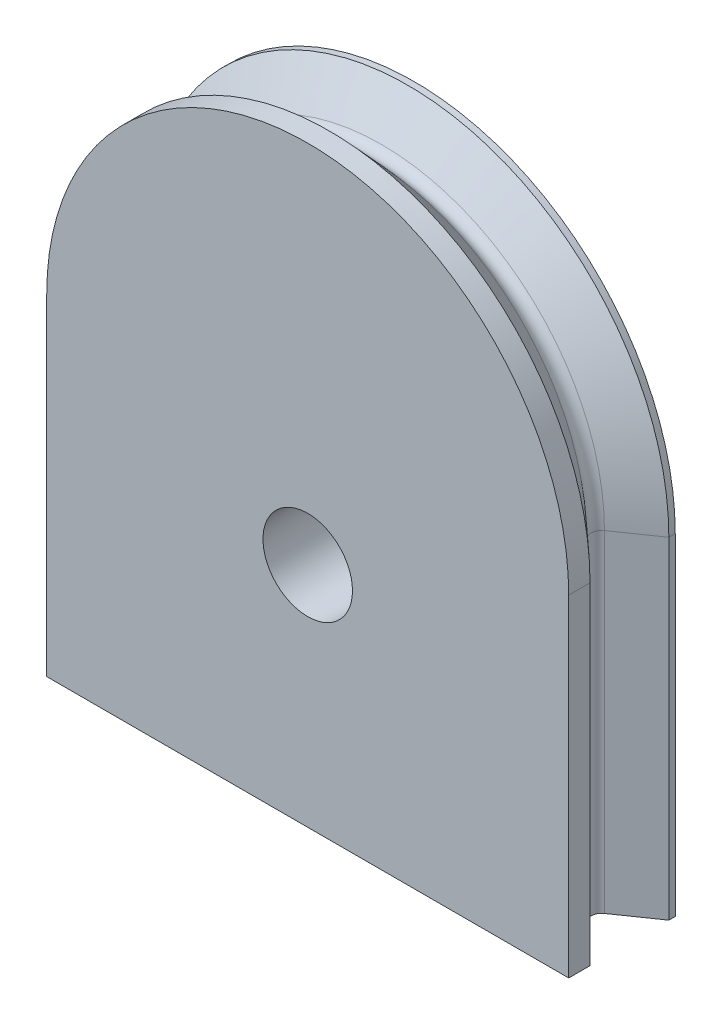
ISO-10303-21;
HEADER;
FILE_DESCRIPTION(('STEP AP214'),'2;1');
FILE_NAME('part.step','',(''),(''),'','','');
FILE_SCHEMA(('AUTOMOTIVE_DESIGN { 1 0 10303 214 1 1 1 1 }'));
ENDSEC;
DATA;
#1=APPLICATION_CONTEXT('core data for automotive mechanical design processes');
#2=APPLICATION_PROTOCOL_DEFINITION('international standard','automotive_design',2000,#1);
#3=PRODUCT_CONTEXT('',#1,'mechanical');
#4=PRODUCT('Part','Part','',(#3));
#5=PRODUCT_RELATED_PRODUCT_CATEGORY('part','',(#4));
#6=PRODUCT_DEFINITION_FORMATION('','',#4);
#7=PRODUCT_DEFINITION_CONTEXT('part definition',#1,'design');
#8=PRODUCT_DEFINITION('design','',#6,#7);
#9=PRODUCT_DEFINITION_SHAPE('','',#8);
#10=(LENGTH_UNIT() NAMED_UNIT(*) SI_UNIT(.MILLI.,.METRE.));
#11=(NAMED_UNIT(*) PLANE_ANGLE_UNIT() SI_UNIT($,.RADIAN.));
#12=(NAMED_UNIT(*) SI_UNIT($,.STERADIAN.) SOLID_ANGLE_UNIT());
#13=UNCERTAINTY_MEASURE_WITH_UNIT(LENGTH_MEASURE(1.E-05),#10,'distance_accuracy_value','');
#14=(GEOMETRIC_REPRESENTATION_CONTEXT(3) GLOBAL_UNCERTAINTY_ASSIGNED_CONTEXT((#13)) GLOBAL_UNIT_ASSIGNED_CONTEXT((#10,
#11,#12)) REPRESENTATION_CONTEXT('',''));
#15=CARTESIAN_POINT('',(0.,0.,0.));
#16=DIRECTION('',(0.,0.,1.));
#17=DIRECTION('',(1.,0.,0.));
#18=AXIS2_PLACEMENT_3D('',#15,#16,#17);
#19=CARTESIAN_POINT('',(1.48873746663725E-09,427.329315402339,345.000000000001));
#20=DIRECTION('',(0.,0.,-1.));
#21=DIRECTION('',(-1.,0.,0.));
#22=AXIS2_PLACEMENT_3D('',#19,#20,#21);
#23=PLANE('',#22);
#24=DIRECTION('',(0.,1.,0.));
#25=VECTOR('',#24,1.);
#26=CARTESIAN_POINT('',(2.10012615747791,429.712168832905,345.000000000001));
#27=LINE('',#26,#25);
#28=CARTESIAN_POINT('',(2.10012615747791,430.223013239108,345.000000000001));
#29=VERTEX_POINT('',#28);
#30=CARTESIAN_POINT('',(2.1001261574759,429.712168832911,345.000000000001));
#31=VERTEX_POINT('',#30);
#32=EDGE_CURVE('E181',#29,#31,#27,.F.);
#33=ORIENTED_EDGE('',*,*,#32,.T.);
#34=CARTESIAN_POINT('',(9.99999999999459,424.435617566144,345.000000000001));
#35=DIRECTION('',(0.,0.,1.));
#36=DIRECTION('',(1.,0.,0.));
#37=AXIS2_PLACEMENT_3D('',#34,#35,#36);
#38=CIRCLE('',#37,9.4999999999225);
#39=CARTESIAN_POINT('',(0.50000000007209,424.435617565571,345.000000000001));
#40=VERTEX_POINT('',#39);
#41=EDGE_CURVE('E225',#40,#31,#38,.F.);
#42=ORIENTED_EDGE('',*,*,#41,.F.);
#43=DIRECTION('',(-1.,0.,0.));
#44=VECTOR('',#43,1.);
#45=CARTESIAN_POINT('',(1.48873746663725E-09,424.435617565571,345.000000000001));
#46=LINE('',#45,#44);
#47=CARTESIAN_POINT('',(-0.49999999770004,424.435617565642,345.000000000001));
#48=VERTEX_POINT('',#47);
#49=EDGE_CURVE('E176',#40,#48,#46,.T.);
#50=ORIENTED_EDGE('',*,*,#49,.T.);
#51=CARTESIAN_POINT('',(-10.0000000000003,424.435617565712,345.000000000001));
#52=DIRECTION('',(0.,0.,1.));
#53=DIRECTION('',(1.,0.,0.));
#54=AXIS2_PLACEMENT_3D('',#51,#52,#53);
#55=CIRCLE('',#54,9.50000000230026);
#56=CARTESIAN_POINT('',(-2.10012615450061,429.712168832297,345.000000000001));
#57=VERTEX_POINT('',#56);
#58=EDGE_CURVE('E215',#57,#48,#55,.F.);
#59=ORIENTED_EDGE('',*,*,#58,.F.);
#60=DIRECTION('',(0.,1.,0.));
#61=VECTOR('',#60,1.);
#62=CARTESIAN_POINT('',(-2.10012615450044,430.223013238468,345.000000000001));
#63=LINE('',#62,#61);
#64=CARTESIAN_POINT('',(-2.1001261545004,430.223013238468,345.000000000001));
#65=VERTEX_POINT('',#64);
#66=EDGE_CURVE('E178',#57,#65,#63,.T.);
#67=ORIENTED_EDGE('',*,*,#66,.T.);
#68=CARTESIAN_POINT('',(-2.85327317332453E-13,440.000000000001,345.000000000001));
#69=DIRECTION('',(0.,0.,1.));
#70=DIRECTION('',(1.,0.,0.));
#71=AXIS2_PLACEMENT_3D('',#68,#69,#70);
#72=CIRCLE('',#71,10.);
#73=EDGE_CURVE('E180',#29,#65,#72,.F.);
#74=ORIENTED_EDGE('',*,*,#73,.F.);
#75=EDGE_LOOP('',(#33,#42,#50,#59,#67,#74));
#76=FACE_BOUND('',#75,.T.);
#77=ADVANCED_FACE('F16',(#76),#23,.T.);
#78=CARTESIAN_POINT('',(-2.84494650060196E-13,440.000000000001,344.300000000001));
#79=DIRECTION('',(0.,0.,-1.));
#80=DIRECTION('',(0.,1.,0.));
#81=AXIS2_PLACEMENT_3D('',#78,#79,#80);
#82=CONICAL_SURFACE('',#81,12.2500000000002,0.963962019791999);
#83=DIRECTION('',(-0.82145743022928,0.,0.570269839918882));
#84=VECTOR('',#83,1.);
#85=CARTESIAN_POINT('',(10.4648650800408,440.000000000079,345.539271284886));
#86=LINE('',#85,#84);
#87=CARTESIAN_POINT('',(10.4648650800408,440.000000000079,345.539271284886));
#88=VERTEX_POINT('',#87);
#89=CARTESIAN_POINT('',(12.2499999999997,440.00000000004,344.300000000001));
#90=VERTEX_POINT('',#89);
#91=EDGE_CURVE('E135',#88,#90,#86,.F.);
#92=ORIENTED_EDGE('',*,*,#91,.T.);
#93=CARTESIAN_POINT('',(-2.84772205816353E-13,440.000000000001,344.300000000001));
#94=DIRECTION('',(0.,0.,1.));
#95=DIRECTION('',(1.,0.,0.));
#96=AXIS2_PLACEMENT_3D('',#93,#94,#95);
#97=CIRCLE('',#96,12.25);
#98=CARTESIAN_POINT('',(-12.2500000000003,439.999999999943,344.300000000001));
#99=VERTEX_POINT('',#98);
#100=EDGE_CURVE('E224',#99,#90,#97,.F.);
#101=ORIENTED_EDGE('',*,*,#100,.F.);
#102=DIRECTION('',(-0.82145743022928,0.,-0.570269839918882));
#103=VECTOR('',#102,1.);
#104=CARTESIAN_POINT('',(-10.4648650800413,439.999999999923,345.539271284886));
#105=LINE('',#104,#103);
#106=CARTESIAN_POINT('',(-10.4648650800413,439.999999999943,345.539271284886));
#107=VERTEX_POINT('',#106);
#108=EDGE_CURVE('E138',#99,#107,#105,.F.);
#109=ORIENTED_EDGE('',*,*,#108,.T.);
#110=CARTESIAN_POINT('',(-2.84772205816353E-13,440.000000000001,345.539271284886));
#111=DIRECTION('',(0.,0.,-1.));
#112=DIRECTION('',(-1.,0.,0.));
#113=AXIS2_PLACEMENT_3D('',#110,#111,#112);
#114=CIRCLE('',#113,10.464865080041);
#115=EDGE_CURVE('E131',#107,#88,#114,.T.);
#116=ORIENTED_EDGE('',*,*,#115,.T.);
#117=EDGE_LOOP('',(#92,#101,#109,#116));
#118=FACE_BOUND('',#117,.T.);
#119=ADVANCED_FACE('F133',(#118),#82,.T.);
#120=CARTESIAN_POINT('',(10.7499999999997,440.000000000079,345.950000000001));
#121=DIRECTION('',(0.,-1.,0.));
#122=DIRECTION('',(1.,0.,0.));
#123=AXIS2_PLACEMENT_3D('',#120,#121,#122);
#124=CYLINDRICAL_SURFACE('',#123,0.500000000000024);
#125=DIRECTION('',(0.,1.,0.));
#126=VECTOR('',#125,1.);
#127=CARTESIAN_POINT('',(10.4124960979293,440.000000000079,346.318905294199));
#128=LINE('',#127,#126);
#129=CARTESIAN_POINT('',(10.4124960979293,440.000000000073,346.318905294199));
#130=VERTEX_POINT('',#129);
#131=CARTESIAN_POINT('',(10.4124960979293,424.435617565601,346.318905294199));
#132=VERTEX_POINT('',#131);
#133=EDGE_CURVE('E247',#130,#132,#128,.F.);
#134=ORIENTED_EDGE('',*,*,#133,.T.);
#135=CARTESIAN_POINT('',(10.7499999999997,424.435617565634,345.950000000001));
#136=DIRECTION('',(0.,-1.,0.));
#137=DIRECTION('',(1.,0.,0.));
#138=AXIS2_PLACEMENT_3D('',#135,#136,#137);
#139=CIRCLE('',#138,0.500000000000024);
#140=CARTESIAN_POINT('',(10.4648650800405,424.435617565601,345.539271284886));
#141=VERTEX_POINT('',#140);
#142=EDGE_CURVE('E19',#141,#132,#139,.F.);
#143=ORIENTED_EDGE('',*,*,#142,.F.);
#144=DIRECTION('',(0.,1.,0.));
#145=VECTOR('',#144,1.);
#146=CARTESIAN_POINT('',(10.4648650800408,440.000000000079,345.539271284886));
#147=LINE('',#146,#145);
#148=EDGE_CURVE('E148',#141,#88,#147,.T.);
#149=ORIENTED_EDGE('',*,*,#148,.T.);
#150=CARTESIAN_POINT('',(10.7499999999997,440.000000000081,345.950000000001));
#151=DIRECTION('',(7.44749851386546E-12,-1.,0.));
#152=DIRECTION('',(1.,7.44749851386546E-12,0.));
#153=AXIS2_PLACEMENT_3D('',#150,#151,#152);
#154=CIRCLE('',#153,0.500000000000024);
#155=EDGE_CURVE('E142',#88,#130,#154,.F.);
#156=ORIENTED_EDGE('',*,*,#155,.T.);
#157=EDGE_LOOP('',(#134,#143,#149,#156));
#158=FACE_BOUND('',#157,.T.);
#159=ADVANCED_FACE('F152',(#158),#124,.F.);
#160=CARTESIAN_POINT('',(-2.84772205816353E-13,440.000000000001,345.950000000001));
#161=DIRECTION('',(0.,0.,-1.));
#162=DIRECTION('',(-1.,0.,0.));
#163=AXIS2_PLACEMENT_3D('',#160,#161,#162);
#164=TOROIDAL_SURFACE('',#163,10.75,0.500000000000024);
#165=CARTESIAN_POINT('',(-2.84772205816353E-13,440.000000000001,346.318905294199));
#166=DIRECTION('',(0.,0.,1.));
#167=DIRECTION('',(-1.,0.,0.));
#168=AXIS2_PLACEMENT_3D('',#165,#166,#167);
#169=CIRCLE('',#168,10.4124960979296);
#170=CARTESIAN_POINT('',(-10.4124960979298,439.999999999923,346.318905294199));
#171=VERTEX_POINT('',#170);
#172=EDGE_CURVE('E158',#130,#171,#169,.T.);
#173=ORIENTED_EDGE('',*,*,#172,.F.);
#174=ORIENTED_EDGE('',*,*,#155,.F.);
#175=ORIENTED_EDGE('',*,*,#115,.F.);
#176=CARTESIAN_POINT('',(-10.7500000000003,439.999999999923,345.950000000001));
#177=DIRECTION('',(0.,1.,0.));
#178=DIRECTION('',(0.,0.,1.));
#179=AXIS2_PLACEMENT_3D('',#176,#177,#178);
#180=CIRCLE('',#179,0.500000000000024);
#181=EDGE_CURVE('E160',#107,#171,#180,.F.);
#182=ORIENTED_EDGE('',*,*,#181,.T.);
#183=EDGE_LOOP('',(#173,#174,#175,#182));
#184=FACE_BOUND('',#183,.T.);
#185=ADVANCED_FACE('F156',(#184),#164,.F.);
#186=CARTESIAN_POINT('',(-10.7500000000003,424.435617565634,345.950000000001));
#187=DIRECTION('',(0.,1.,0.));
#188=DIRECTION('',(0.,0.,1.));
#189=AXIS2_PLACEMENT_3D('',#186,#187,#188);
#190=CYLINDRICAL_SURFACE('',#189,0.500000000000024);
#191=DIRECTION('',(0.,1.,0.));
#192=VECTOR('',#191,1.);
#193=CARTESIAN_POINT('',(-10.4124960979298,424.435617565634,346.318905294199));
#194=LINE('',#193,#192);
#195=CARTESIAN_POINT('',(-10.4124960979298,424.435617565667,346.318905294199));
#196=VERTEX_POINT('',#195);
#197=EDGE_CURVE('E292',#196,#171,#194,.T.);
#198=ORIENTED_EDGE('',*,*,#197,.T.);
#199=ORIENTED_EDGE('',*,*,#181,.F.);
#200=DIRECTION('',(0.,1.,0.));
#201=VECTOR('',#200,1.);
#202=CARTESIAN_POINT('',(-10.4648650800413,424.435617565634,345.539271284886));
#203=LINE('',#202,#201);
#204=CARTESIAN_POINT('',(-10.4648650800411,424.435617565667,345.539271284886));
#205=VERTEX_POINT('',#204);
#206=EDGE_CURVE('E171',#107,#205,#203,.F.);
#207=ORIENTED_EDGE('',*,*,#206,.T.);
#208=CARTESIAN_POINT('',(-10.7500000000003,424.435617565634,345.950000000001));
#209=DIRECTION('',(0.,1.,0.));
#210=DIRECTION('',(0.,0.,1.));
#211=AXIS2_PLACEMENT_3D('',#208,#209,#210);
#212=CIRCLE('',#211,0.500000000000024);
#213=EDGE_CURVE('E162',#196,#205,#212,.T.);
#214=ORIENTED_EDGE('',*,*,#213,.F.);
#215=EDGE_LOOP('',(#198,#199,#207,#214));
#216=FACE_BOUND('',#215,.T.);
#217=ADVANCED_FACE('F245',(#216),#190,.F.);
#218=CARTESIAN_POINT('',(-2.10012615450044,430.223013238468,344.000000000001));
#219=DIRECTION('',(-1.,0.,0.));
#220=DIRECTION('',(0.,0.,1.));
#221=AXIS2_PLACEMENT_3D('',#218,#219,#220);
#222=PLANE('',#221);
#223=DIRECTION('',(0.,0.,1.));
#224=VECTOR('',#223,1.);
#225=CARTESIAN_POINT('',(-2.10012615450036,430.223013238468,344.000000000001));
#226=LINE('',#225,#224);
#227=CARTESIAN_POINT('',(-2.1001261545004,430.223013238468,344.000000000001));
#228=VERTEX_POINT('',#227);
#229=EDGE_CURVE('E230',#65,#228,#226,.F.);
#230=ORIENTED_EDGE('',*,*,#229,.F.);
#231=ORIENTED_EDGE('',*,*,#66,.F.);
#232=DIRECTION('',(0.,0.,1.));
#233=VECTOR('',#232,1.);
#234=CARTESIAN_POINT('',(-2.10012615450077,429.712168832297,344.000000000001));
#235=LINE('',#234,#233);
#236=CARTESIAN_POINT('',(-2.10012615450061,429.712168832297,344.000000000001));
#237=VERTEX_POINT('',#236);
#238=EDGE_CURVE('E219',#237,#57,#235,.T.);
#239=ORIENTED_EDGE('',*,*,#238,.F.);
#240=DIRECTION('',(0.,1.,0.));
#241=VECTOR('',#240,1.);
#242=CARTESIAN_POINT('',(-2.10012615450044,438.342808782779,344.000000000001));
#243=LINE('',#242,#241);
#244=EDGE_CURVE('E214',#237,#228,#243,.T.);
#245=ORIENTED_EDGE('',*,*,#244,.T.);
#246=EDGE_LOOP('',(#230,#231,#239,#245));
#247=FACE_BOUND('',#246,.T.);
#248=ADVANCED_FACE('F591',(#247),#222,.F.);
#249=CARTESIAN_POINT('',(-2.85327317332453E-13,440.000000000001,344.000000000001));
#250=DIRECTION('',(0.,0.,1.));
#251=DIRECTION('',(1.,0.,0.));
#252=AXIS2_PLACEMENT_3D('',#249,#250,#251);
#253=CYLINDRICAL_SURFACE('',#252,10.);
#254=ORIENTED_EDGE('',*,*,#73,.T.);
#255=ORIENTED_EDGE('',*,*,#229,.T.);
#256=CARTESIAN_POINT('',(-2.85327317332453E-13,440.000000000001,344.000000000001));
#257=DIRECTION('',(0.,0.,1.));
#258=DIRECTION('',(1.,0.,0.));
#259=AXIS2_PLACEMENT_3D('',#256,#257,#258);
#260=CIRCLE('',#259,10.);
#261=CARTESIAN_POINT('',(2.10012615747791,430.223013239108,344.000000000001));
#262=VERTEX_POINT('',#261);
#263=EDGE_CURVE('E212',#228,#262,#260,.T.);
#264=ORIENTED_EDGE('',*,*,#263,.T.);
#265=DIRECTION('',(0.,0.,-1.));
#266=VECTOR('',#265,1.);
#267=CARTESIAN_POINT('',(2.10012615747791,430.223013239108,344.000000000001));
#268=LINE('',#267,#266);
#269=EDGE_CURVE('E183',#262,#29,#268,.F.);
#270=ORIENTED_EDGE('',*,*,#269,.T.);
#271=EDGE_LOOP('',(#254,#255,#264,#270));
#272=FACE_BOUND('',#271,.T.);
#273=ADVANCED_FACE('F582',(#272),#253,.T.);
#274=CARTESIAN_POINT('',(2.10012615747791,429.712168832905,344.000000000001));
#275=DIRECTION('',(1.,0.,0.));
#276=DIRECTION('',(0.,0.,-1.));
#277=AXIS2_PLACEMENT_3D('',#274,#275,#276);
#278=PLANE('',#277);
#279=DIRECTION('',(0.,0.,1.));
#280=VECTOR('',#279,1.);
#281=CARTESIAN_POINT('',(2.1001261574739,429.712168832908,344.000000000001));
#282=LINE('',#281,#280);
#283=CARTESIAN_POINT('',(2.1001261574759,429.712168832911,344.000000000001));
#284=VERTEX_POINT('',#283);
#285=EDGE_CURVE('E228',#31,#284,#282,.F.);
#286=ORIENTED_EDGE('',*,*,#285,.F.);
#287=ORIENTED_EDGE('',*,*,#32,.F.);
#288=ORIENTED_EDGE('',*,*,#269,.F.);
#289=DIRECTION('',(0.,1.,0.));
#290=VECTOR('',#289,1.);
#291=CARTESIAN_POINT('',(2.10012615747791,438.342808782779,344.000000000001));
#292=LINE('',#291,#290);
#293=EDGE_CURVE('E211',#262,#284,#292,.F.);
#294=ORIENTED_EDGE('',*,*,#293,.T.);
#295=EDGE_LOOP('',(#286,#287,#288,#294));
#296=FACE_BOUND('',#295,.T.);
#297=ADVANCED_FACE('F574',(#296),#278,.F.);
#298=CARTESIAN_POINT('',(9.99999999999459,424.435617566144,344.000000000001));
#299=DIRECTION('',(0.,0.,1.));
#300=DIRECTION('',(1.,0.,0.));
#301=AXIS2_PLACEMENT_3D('',#298,#299,#300);
#302=CYLINDRICAL_SURFACE('',#301,9.4999999999225);
#303=ORIENTED_EDGE('',*,*,#41,.T.);
#304=ORIENTED_EDGE('',*,*,#285,.T.);
#305=CARTESIAN_POINT('',(9.99999999999459,424.435617566144,344.000000000001));
#306=DIRECTION('',(0.,0.,1.));
#307=DIRECTION('',(1.,0.,0.));
#308=AXIS2_PLACEMENT_3D('',#305,#306,#307);
#309=CIRCLE('',#308,9.4999999999225);
#310=CARTESIAN_POINT('',(0.50000000007209,424.435617565601,344.000000000001));
#311=VERTEX_POINT('',#310);
#312=EDGE_CURVE('E208',#284,#311,#309,.T.);
#313=ORIENTED_EDGE('',*,*,#312,.T.);
#314=DIRECTION('',(0.,0.,1.));
#315=VECTOR('',#314,1.);
#316=CARTESIAN_POINT('',(0.50000000007209,424.435617565571,344.000000000001));
#317=LINE('',#316,#315);
#318=EDGE_CURVE('E182',#311,#40,#317,.T.);
#319=ORIENTED_EDGE('',*,*,#318,.T.);
#320=EDGE_LOOP('',(#303,#304,#313,#319));
#321=FACE_BOUND('',#320,.T.);
#322=ADVANCED_FACE('F424',(#321),#302,.T.);
#323=CARTESIAN_POINT('',(12.2499999999997,424.435617565556,344.000000000001));
#324=DIRECTION('',(1.,0.,0.));
#325=DIRECTION('',(0.,1.,0.));
#326=AXIS2_PLACEMENT_3D('',#323,#324,#325);
#327=PLANE('',#326);
#328=DIRECTION('',(0.,1.,0.));
#329=VECTOR('',#328,1.);
#330=CARTESIAN_POINT('',(12.2499999999997,438.342808782779,344.000000000001));
#331=LINE('',#330,#329);
#332=CARTESIAN_POINT('',(12.2499999999997,424.435617565587,344.000000000001));
#333=VERTEX_POINT('',#332);
#334=CARTESIAN_POINT('',(12.2499999999997,440.000000000001,344.000000000001));
#335=VERTEX_POINT('',#334);
#336=EDGE_CURVE('E207',#333,#335,#331,.T.);
#337=ORIENTED_EDGE('',*,*,#336,.T.);
#338=DIRECTION('',(0.,0.,1.));
#339=VECTOR('',#338,1.);
#340=CARTESIAN_POINT('',(12.2499999999997,440.000000000001,344.000000000001));
#341=LINE('',#340,#339);
#342=EDGE_CURVE('E220',#90,#335,#341,.F.);
#343=ORIENTED_EDGE('',*,*,#342,.F.);
#344=DIRECTION('',(0.,1.,0.));
#345=VECTOR('',#344,1.);
#346=CARTESIAN_POINT('',(12.2499999999997,440.000000000079,344.300000000001));
#347=LINE('',#346,#345);
#348=CARTESIAN_POINT('',(12.2499999999997,424.435617565582,344.300000000001));
#349=VERTEX_POINT('',#348);
#350=EDGE_CURVE('E149',#90,#349,#347,.F.);
#351=ORIENTED_EDGE('',*,*,#350,.T.);
#352=DIRECTION('',(0.,0.,1.));
#353=VECTOR('',#352,1.);
#354=CARTESIAN_POINT('',(12.2499999999997,424.435617565634,344.000000000001));
#355=LINE('',#354,#353);
#356=EDGE_CURVE('E117',#349,#333,#355,.F.);
#357=ORIENTED_EDGE('',*,*,#356,.T.);
#358=EDGE_LOOP('',(#337,#343,#351,#357));
#359=FACE_BOUND('',#358,.T.);
#360=ADVANCED_FACE('F429',(#359),#327,.T.);
#361=CARTESIAN_POINT('',(-2.84772205816353E-13,440.000000000001,344.000000000001));
#362=DIRECTION('',(0.,0.,1.));
#363=DIRECTION('',(1.,0.,0.));
#364=AXIS2_PLACEMENT_3D('',#361,#362,#363);
#365=CYLINDRICAL_SURFACE('',#364,12.25);
#366=CARTESIAN_POINT('',(-2.84772205816353E-13,440.000000000001,344.000000000001));
#367=DIRECTION('',(0.,0.,1.));
#368=DIRECTION('',(1.,0.,0.));
#369=AXIS2_PLACEMENT_3D('',#366,#367,#368);
#370=CIRCLE('',#369,12.25);
#371=CARTESIAN_POINT('',(-12.2500000000003,439.999999999962,344.000000000001));
#372=VERTEX_POINT('',#371);
#373=EDGE_CURVE('E205',#335,#372,#370,.T.);
#374=ORIENTED_EDGE('',*,*,#373,.T.);
#375=DIRECTION('',(0.,0.,1.));
#376=VECTOR('',#375,1.);
#377=CARTESIAN_POINT('',(-12.2500000000003,439.999999999923,344.000000000001));
#378=LINE('',#377,#376);
#379=EDGE_CURVE('E223',#99,#372,#378,.F.);
#380=ORIENTED_EDGE('',*,*,#379,.F.);
#381=ORIENTED_EDGE('',*,*,#100,.T.);
#382=ORIENTED_EDGE('',*,*,#342,.T.);
#383=EDGE_LOOP('',(#374,#380,#381,#382));
#384=FACE_BOUND('',#383,.T.);
#385=ADVANCED_FACE('F403',(#384),#365,.T.);
#386=CARTESIAN_POINT('',(-12.2500000000003,440.000000000001,344.000000000001));
#387=DIRECTION('',(-1.,0.,0.));
#388=DIRECTION('',(0.,0.,1.));
#389=AXIS2_PLACEMENT_3D('',#386,#387,#388);
#390=PLANE('',#389);
#391=DIRECTION('',(0.,1.,0.));
#392=VECTOR('',#391,1.);
#393=CARTESIAN_POINT('',(-12.2500000000003,438.342808782779,344.000000000001));
#394=LINE('',#393,#392);
#395=CARTESIAN_POINT('',(-12.2500000000003,424.435617565712,344.000000000001));
#396=VERTEX_POINT('',#395);
#397=EDGE_CURVE('E204',#372,#396,#394,.F.);
#398=ORIENTED_EDGE('',*,*,#397,.T.);
#399=DIRECTION('',(0.,0.,1.));
#400=VECTOR('',#399,1.);
#401=CARTESIAN_POINT('',(-12.2500000000003,424.435617565712,344.000000000001));
#402=LINE('',#401,#400);
#403=CARTESIAN_POINT('',(-12.2500000000003,424.435617565712,344.300000000001));
#404=VERTEX_POINT('',#403);
#405=EDGE_CURVE('E328',#396,#404,#402,.T.);
#406=ORIENTED_EDGE('',*,*,#405,.T.);
#407=DIRECTION('',(0.,1.,0.));
#408=VECTOR('',#407,1.);
#409=CARTESIAN_POINT('',(-12.2500000000003,424.435617565634,344.300000000001));
#410=LINE('',#409,#408);
#411=EDGE_CURVE('E150',#404,#99,#410,.T.);
#412=ORIENTED_EDGE('',*,*,#411,.T.);
#413=ORIENTED_EDGE('',*,*,#379,.T.);
#414=EDGE_LOOP('',(#398,#406,#412,#413));
#415=FACE_BOUND('',#414,.T.);
#416=ADVANCED_FACE('F407',(#415),#390,.T.);
#417=CARTESIAN_POINT('',(-10.0000000000003,424.435617565712,344.000000000001));
#418=DIRECTION('',(0.,0.,1.));
#419=DIRECTION('',(1.,0.,0.));
#420=AXIS2_PLACEMENT_3D('',#417,#418,#419);
#421=CYLINDRICAL_SURFACE('',#420,9.50000000230026);
#422=ORIENTED_EDGE('',*,*,#58,.T.);
#423=DIRECTION('',(0.,0.,1.));
#424=VECTOR('',#423,1.);
#425=CARTESIAN_POINT('',(-0.49999999770004,424.435617565712,344.000000000001));
#426=LINE('',#425,#424);
#427=CARTESIAN_POINT('',(-0.49999999770004,424.435617565675,344.000000000001));
#428=VERTEX_POINT('',#427);
#429=EDGE_CURVE('E218',#48,#428,#426,.F.);
#430=ORIENTED_EDGE('',*,*,#429,.T.);
#431=CARTESIAN_POINT('',(-10.0000000000003,424.435617565712,344.000000000001));
#432=DIRECTION('',(0.,0.,1.));
#433=DIRECTION('',(1.,0.,0.));
#434=AXIS2_PLACEMENT_3D('',#431,#432,#433);
#435=CIRCLE('',#434,9.50000000230026);
#436=EDGE_CURVE('E200',#428,#237,#435,.T.);
#437=ORIENTED_EDGE('',*,*,#436,.T.);
#438=ORIENTED_EDGE('',*,*,#238,.T.);
#439=EDGE_LOOP('',(#422,#430,#437,#438));
#440=FACE_BOUND('',#439,.T.);
#441=ADVANCED_FACE('F416',(#440),#421,.T.);
#442=CARTESIAN_POINT('',(10.4648650800408,440.000000000079,345.539271284886));
#443=DIRECTION('',(-0.570269839918882,0.,-0.82145743022928));
#444=DIRECTION('',(-0.82145743022928,0.,0.570269839918882));
#445=AXIS2_PLACEMENT_3D('',#442,#443,#444);
#446=PLANE('',#445);
#447=ORIENTED_EDGE('',*,*,#148,.F.);
#448=DIRECTION('',(-0.82145743022927,5.23658445172995E-12,0.570269839918897));
#449=VECTOR('',#448,1.);
#450=CARTESIAN_POINT('',(12.2499999999997,424.435617565556,344.300000000001));
#451=LINE('',#450,#449);
#452=EDGE_CURVE('E269',#349,#141,#451,.T.);
#453=ORIENTED_EDGE('',*,*,#452,.F.);
#454=ORIENTED_EDGE('',*,*,#350,.F.);
#455=ORIENTED_EDGE('',*,*,#91,.F.);
#456=EDGE_LOOP('',(#447,#453,#454,#455));
#457=FACE_BOUND('',#456,.T.);
#458=ADVANCED_FACE('F146',(#457),#446,.F.);
#459=CARTESIAN_POINT('',(-10.4648650800413,424.435617565634,345.539271284886));
#460=DIRECTION('',(0.570269839918882,0.,-0.82145743022928));
#461=DIRECTION('',(-0.82145743022928,0.,-0.570269839918882));
#462=AXIS2_PLACEMENT_3D('',#459,#460,#461);
#463=PLANE('',#462);
#464=ORIENTED_EDGE('',*,*,#206,.F.);
#465=ORIENTED_EDGE('',*,*,#108,.F.);
#466=ORIENTED_EDGE('',*,*,#411,.F.);
#467=DIRECTION('',(-0.821457430229285,5.23658445172975E-12,-0.570269839918876));
#468=VECTOR('',#467,1.);
#469=CARTESIAN_POINT('',(-10.4648650800413,424.435617565701,345.539271284886));
#470=LINE('',#469,#468);
#471=EDGE_CURVE('E237',#205,#404,#470,.T.);
#472=ORIENTED_EDGE('',*,*,#471,.F.);
#473=EDGE_LOOP('',(#464,#465,#466,#472));
#474=FACE_BOUND('',#473,.T.);
#475=ADVANCED_FACE('F250',(#474),#463,.F.);
#476=CARTESIAN_POINT('',(12.2499999999997,440.000000000079,348.000000000001));
#477=DIRECTION('',(-0.675007804140848,0.,0.737810588395796));
#478=DIRECTION('',(0.737810588395796,0.,0.675007804140848));
#479=AXIS2_PLACEMENT_3D('',#476,#477,#478);
#480=PLANE('',#479);
#481=DIRECTION('',(0.,1.,0.));
#482=VECTOR('',#481,1.);
#483=CARTESIAN_POINT('',(12.2499999999997,424.435617565556,348.000000000001));
#484=LINE('',#483,#482);
#485=CARTESIAN_POINT('',(12.2499999999997,424.435617565556,348.000000000001));
#486=VERTEX_POINT('',#485);
#487=CARTESIAN_POINT('',(12.2499999999997,440.00000000004,348.000000000001));
#488=VERTEX_POINT('',#487);
#489=EDGE_CURVE('E255',#486,#488,#484,.T.);
#490=ORIENTED_EDGE('',*,*,#489,.F.);
#491=DIRECTION('',(0.737810588395778,-4.70304682750995E-12,0.675007804140868));
#492=VECTOR('',#491,1.);
#493=CARTESIAN_POINT('',(10.4124960979293,424.435617565568,346.318905294199));
#494=LINE('',#493,#492);
#495=EDGE_CURVE('E257',#132,#486,#494,.T.);
#496=ORIENTED_EDGE('',*,*,#495,.F.);
#497=ORIENTED_EDGE('',*,*,#133,.F.);
#498=DIRECTION('',(-0.737810588395796,-4.69387685445586E-12,-0.675007804140848));
#499=VECTOR('',#498,1.);
#500=CARTESIAN_POINT('',(11.3312480489645,440.000000000073,347.1594526471));
#501=LINE('',#500,#499);
#502=EDGE_CURVE('E300',#488,#130,#501,.T.);
#503=ORIENTED_EDGE('',*,*,#502,.F.);
#504=EDGE_LOOP('',(#490,#496,#497,#503));
#505=FACE_BOUND('',#504,.T.);
#506=ADVANCED_FACE('F431',(#505),#480,.F.);
#507=CARTESIAN_POINT('',(-2.84494650060196E-13,440.000000000001,348.000000000001));
#508=DIRECTION('',(0.,0.,1.));
#509=DIRECTION('',(1.,0.,0.));
#510=AXIS2_PLACEMENT_3D('',#507,#508,#509);
#511=CONICAL_SURFACE('',#510,12.2500000000001,0.829821047211705);
#512=ORIENTED_EDGE('',*,*,#502,.T.);
#513=ORIENTED_EDGE('',*,*,#172,.T.);
#514=DIRECTION('',(0.737810588395796,0.,-0.675007804140848));
#515=VECTOR('',#514,1.);
#516=CARTESIAN_POINT('',(-12.2500000000003,439.999999999923,348.000000000001));
#517=LINE('',#516,#515);
#518=CARTESIAN_POINT('',(-12.2500000000003,439.999999999952,348.000000000001));
#519=VERTEX_POINT('',#518);
#520=EDGE_CURVE('E284',#171,#519,#517,.F.);
#521=ORIENTED_EDGE('',*,*,#520,.T.);
#522=CARTESIAN_POINT('',(-2.84772205816353E-13,440.000000000001,348.000000000001));
#523=DIRECTION('',(0.,0.,1.));
#524=DIRECTION('',(1.,0.,0.));
#525=AXIS2_PLACEMENT_3D('',#522,#523,#524);
#526=CIRCLE('',#525,12.25);
#527=EDGE_CURVE('E199',#488,#519,#526,.T.);
#528=ORIENTED_EDGE('',*,*,#527,.F.);
#529=EDGE_LOOP('',(#512,#513,#521,#528));
#530=FACE_BOUND('',#529,.T.);
#531=ADVANCED_FACE('F356',(#530),#511,.T.);
#532=CARTESIAN_POINT('',(-12.2500000000003,424.435617565634,348.000000000001));
#533=DIRECTION('',(0.675007804140848,0.,0.737810588395796));
#534=DIRECTION('',(0.737810588395796,0.,-0.675007804140848));
#535=AXIS2_PLACEMENT_3D('',#532,#533,#534);
#536=PLANE('',#535);
#537=DIRECTION('',(0.,1.,0.));
#538=VECTOR('',#537,1.);
#539=CARTESIAN_POINT('',(-12.2500000000003,440.000000000001,348.000000000001));
#540=LINE('',#539,#538);
#541=CARTESIAN_POINT('',(-12.2500000000003,424.43561756566,348.000000000001));
#542=VERTEX_POINT('',#541);
#543=EDGE_CURVE('E198',#519,#542,#540,.F.);
#544=ORIENTED_EDGE('',*,*,#543,.F.);
#545=ORIENTED_EDGE('',*,*,#520,.F.);
#546=ORIENTED_EDGE('',*,*,#197,.F.);
#547=DIRECTION('',(0.737810588395796,-4.70304682750981E-12,-0.675007804140848));
#548=VECTOR('',#547,1.);
#549=CARTESIAN_POINT('',(-12.2500000000003,424.435617565712,348.000000000001));
#550=LINE('',#549,#548);
#551=EDGE_CURVE('E240',#542,#196,#550,.T.);
#552=ORIENTED_EDGE('',*,*,#551,.F.);
#553=EDGE_LOOP('',(#544,#545,#546,#552));
#554=FACE_BOUND('',#553,.T.);
#555=ADVANCED_FACE('F360',(#554),#536,.F.);
#556=CARTESIAN_POINT('',(-2.79776202205539E-13,438.342808782779,344.000000000001));
#557=DIRECTION('',(0.,0.,1.));
#558=DIRECTION('',(1.,0.,0.));
#559=AXIS2_PLACEMENT_3D('',#556,#557,#558);
#560=PLANE('',#559);
#561=CARTESIAN_POINT('',(-2.85327317332453E-13,435.100000000001,344.000000000001));
#562=DIRECTION('',(0.,0.,1.));
#563=DIRECTION('',(1.,0.,0.));
#564=AXIS2_PLACEMENT_3D('',#561,#562,#563);
#565=CIRCLE('',#564,2.10000000000003);
#566=CARTESIAN_POINT('',(2.09999999999974,435.100000000001,344.000000000001));
#567=VERTEX_POINT('',#566);
#568=EDGE_CURVE('E191',#567,#567,#565,.T.);
#569=ORIENTED_EDGE('',*,*,#568,.T.);
#570=EDGE_LOOP('',(#569));
#571=FACE_BOUND('',#570,.T.);
#572=DIRECTION('',(1.,-6.37458340081918E-12,0.));
#573=VECTOR('',#572,1.);
#574=CARTESIAN_POINT('',(-12.2500000000003,424.435617565712,344.000000000001));
#575=LINE('',#574,#573);
#576=EDGE_CURVE('E252',#396,#428,#575,.T.);
#577=ORIENTED_EDGE('',*,*,#576,.F.);
#578=ORIENTED_EDGE('',*,*,#397,.F.);
#579=ORIENTED_EDGE('',*,*,#373,.F.);
#580=ORIENTED_EDGE('',*,*,#336,.F.);
#581=DIRECTION('',(1.,-6.37458340081918E-12,0.));
#582=VECTOR('',#581,1.);
#583=CARTESIAN_POINT('',(-12.2500000000003,424.435617565712,344.000000000001));
#584=LINE('',#583,#582);
#585=EDGE_CURVE('E203',#311,#333,#584,.T.);
#586=ORIENTED_EDGE('',*,*,#585,.F.);
#587=ORIENTED_EDGE('',*,*,#312,.F.);
#588=ORIENTED_EDGE('',*,*,#293,.F.);
#589=ORIENTED_EDGE('',*,*,#263,.F.);
#590=ORIENTED_EDGE('',*,*,#244,.F.);
#591=ORIENTED_EDGE('',*,*,#436,.F.);
#592=EDGE_LOOP('',(#577,#578,#579,#580,#586,#587,#588,#589,#590,#591));
#593=FACE_BOUND('',#592,.T.);
#594=ADVANCED_FACE('F412',(#571,#593),#560,.F.);
#595=CARTESIAN_POINT('',(-12.2500000000003,424.435617565712,344.000000000001));
#596=DIRECTION('',(-6.37458340081918E-12,-1.,0.));
#597=DIRECTION('',(1.,-6.37458340081918E-12,0.));
#598=AXIS2_PLACEMENT_3D('',#595,#596,#597);
#599=PLANE('',#598);
#600=ORIENTED_EDGE('',*,*,#405,.F.);
#601=ORIENTED_EDGE('',*,*,#576,.T.);
#602=ORIENTED_EDGE('',*,*,#429,.F.);
#603=ORIENTED_EDGE('',*,*,#49,.F.);
#604=ORIENTED_EDGE('',*,*,#318,.F.);
#605=ORIENTED_EDGE('',*,*,#585,.T.);
#606=ORIENTED_EDGE('',*,*,#356,.F.);
#607=ORIENTED_EDGE('',*,*,#452,.T.);
#608=ORIENTED_EDGE('',*,*,#142,.T.);
#609=ORIENTED_EDGE('',*,*,#495,.T.);
#610=DIRECTION('',(0.,0.,1.));
#611=VECTOR('',#610,1.);
#612=CARTESIAN_POINT('',(12.2499999999997,424.435617565556,344.000000000001));
#613=LINE('',#612,#611);
#614=CARTESIAN_POINT('',(12.2499999999997,424.43561756566,349.000000000001));
#615=VERTEX_POINT('',#614);
#616=EDGE_CURVE('E297',#615,#486,#613,.F.);
#617=ORIENTED_EDGE('',*,*,#616,.F.);
#618=DIRECTION('',(1.,0.,0.));
#619=VECTOR('',#618,1.);
#620=CARTESIAN_POINT('',(-2.79776202205539E-13,424.435617565712,349.000000000001));
#621=LINE('',#620,#619);
#622=CARTESIAN_POINT('',(-12.2500000000003,424.435617565686,349.000000000001));
#623=VERTEX_POINT('',#622);
#624=EDGE_CURVE('E194',#623,#615,#621,.T.);
#625=ORIENTED_EDGE('',*,*,#624,.F.);
#626=DIRECTION('',(0.,0.,1.));
#627=VECTOR('',#626,1.);
#628=CARTESIAN_POINT('',(-12.2500000000003,424.435617565634,344.000000000001));
#629=LINE('',#628,#627);
#630=EDGE_CURVE('E287',#542,#623,#629,.T.);
#631=ORIENTED_EDGE('',*,*,#630,.F.);
#632=ORIENTED_EDGE('',*,*,#551,.T.);
#633=ORIENTED_EDGE('',*,*,#213,.T.);
#634=ORIENTED_EDGE('',*,*,#471,.T.);
#635=EDGE_LOOP('',(#600,#601,#602,#603,#604,#605,#606,#607,#608,#609,#617,#625,#631,#632,#633,#634));
#636=FACE_BOUND('',#635,.T.);
#637=ADVANCED_FACE('F235',(#636),#599,.T.);
#638=CARTESIAN_POINT('',(12.2499999999997,424.435617565556,344.000000000001));
#639=DIRECTION('',(1.,0.,0.));
#640=DIRECTION('',(0.,1.,0.));
#641=AXIS2_PLACEMENT_3D('',#638,#639,#640);
#642=PLANE('',#641);
#643=DIRECTION('',(0.,1.,0.));
#644=VECTOR('',#643,1.);
#645=CARTESIAN_POINT('',(12.2499999999997,438.342808782779,349.000000000001));
#646=LINE('',#645,#644);
#647=CARTESIAN_POINT('',(12.2499999999997,440.00000000004,349.000000000001));
#648=VERTEX_POINT('',#647);
#649=EDGE_CURVE('E190',#615,#648,#646,.T.);
#650=ORIENTED_EDGE('',*,*,#649,.F.);
#651=ORIENTED_EDGE('',*,*,#616,.T.);
#652=ORIENTED_EDGE('',*,*,#489,.T.);
#653=DIRECTION('',(0.,0.,1.));
#654=VECTOR('',#653,1.);
#655=CARTESIAN_POINT('',(12.2499999999997,440.000000000079,344.000000000001));
#656=LINE('',#655,#654);
#657=EDGE_CURVE('E195',#648,#488,#656,.F.);
#658=ORIENTED_EDGE('',*,*,#657,.F.);
#659=EDGE_LOOP('',(#650,#651,#652,#658));
#660=FACE_BOUND('',#659,.T.);
#661=ADVANCED_FACE('F388',(#660),#642,.T.);
#662=CARTESIAN_POINT('',(-2.84772205816353E-13,440.000000000001,344.000000000001));
#663=DIRECTION('',(0.,0.,1.));
#664=DIRECTION('',(1.,0.,0.));
#665=AXIS2_PLACEMENT_3D('',#662,#663,#664);
#666=CYLINDRICAL_SURFACE('',#665,12.25);
#667=CARTESIAN_POINT('',(-2.84772205816353E-13,440.000000000001,349.000000000001));
#668=DIRECTION('',(0.,0.,1.));
#669=DIRECTION('',(1.,0.,0.));
#670=AXIS2_PLACEMENT_3D('',#667,#668,#669);
#671=CIRCLE('',#670,12.25);
#672=CARTESIAN_POINT('',(-12.2500000000003,440.000000000001,349.000000000001));
#673=VERTEX_POINT('',#672);
#674=EDGE_CURVE('E187',#648,#673,#671,.T.);
#675=ORIENTED_EDGE('',*,*,#674,.F.);
#676=ORIENTED_EDGE('',*,*,#657,.T.);
#677=ORIENTED_EDGE('',*,*,#527,.T.);
#678=DIRECTION('',(0.,0.,1.));
#679=VECTOR('',#678,1.);
#680=CARTESIAN_POINT('',(-12.2500000000003,440.000000000001,344.000000000001));
#681=LINE('',#680,#679);
#682=EDGE_CURVE('E34',#673,#519,#681,.F.);
#683=ORIENTED_EDGE('',*,*,#682,.F.);
#684=EDGE_LOOP('',(#675,#676,#677,#683));
#685=FACE_BOUND('',#684,.T.);
#686=ADVANCED_FACE('F365',(#685),#666,.T.);
#687=CARTESIAN_POINT('',(-12.2500000000003,440.000000000001,344.000000000001));
#688=DIRECTION('',(-1.,0.,0.));
#689=DIRECTION('',(0.,0.,1.));
#690=AXIS2_PLACEMENT_3D('',#687,#688,#689);
#691=PLANE('',#690);
#692=DIRECTION('',(0.,1.,0.));
#693=VECTOR('',#692,1.);
#694=CARTESIAN_POINT('',(-12.2500000000003,438.342808782779,349.000000000001));
#695=LINE('',#694,#693);
#696=EDGE_CURVE('E25',#673,#623,#695,.F.);
#697=ORIENTED_EDGE('',*,*,#696,.F.);
#698=ORIENTED_EDGE('',*,*,#682,.T.);
#699=ORIENTED_EDGE('',*,*,#543,.T.);
#700=ORIENTED_EDGE('',*,*,#630,.T.);
#701=EDGE_LOOP('',(#697,#698,#699,#700));
#702=FACE_BOUND('',#701,.T.);
#703=ADVANCED_FACE('F367',(#702),#691,.T.);
#704=CARTESIAN_POINT('',(-2.85327317332453E-13,435.100000000001,344.000000000001));
#705=DIRECTION('',(0.,0.,1.));
#706=DIRECTION('',(1.,0.,0.));
#707=AXIS2_PLACEMENT_3D('',#704,#705,#706);
#708=CYLINDRICAL_SURFACE('',#707,2.10000000000003);
#709=ORIENTED_EDGE('',*,*,#568,.F.);
#710=EDGE_LOOP('',(#709));
#711=FACE_BOUND('',#710,.T.);
#712=CARTESIAN_POINT('',(-2.85327317332453E-13,435.100000000001,349.000000000001));
#713=DIRECTION('',(0.,0.,1.));
#714=DIRECTION('',(1.,0.,0.));
#715=AXIS2_PLACEMENT_3D('',#712,#713,#714);
#716=CIRCLE('',#715,2.10000000000003);
#717=CARTESIAN_POINT('',(2.09999999999974,435.100000000001,349.000000000001));
#718=VERTEX_POINT('',#717);
#719=EDGE_CURVE('E11',#718,#718,#716,.F.);
#720=ORIENTED_EDGE('',*,*,#719,.F.);
#721=EDGE_LOOP('',(#720));
#722=FACE_BOUND('',#721,.T.);
#723=ADVANCED_FACE('F443',(#711,#722),#708,.F.);
#724=CARTESIAN_POINT('',(-2.79776202205539E-13,438.342808782779,349.000000000001));
#725=DIRECTION('',(0.,0.,1.));
#726=DIRECTION('',(1.,0.,0.));
#727=AXIS2_PLACEMENT_3D('',#724,#725,#726);
#728=PLANE('',#727);
#729=ORIENTED_EDGE('',*,*,#719,.T.);
#730=EDGE_LOOP('',(#729));
#731=FACE_BOUND('',#730,.T.);
#732=ORIENTED_EDGE('',*,*,#674,.T.);
#733=ORIENTED_EDGE('',*,*,#696,.T.);
#734=ORIENTED_EDGE('',*,*,#624,.T.);
#735=ORIENTED_EDGE('',*,*,#649,.T.);
#736=EDGE_LOOP('',(#732,#733,#734,#735));
#737=FACE_BOUND('',#736,.T.);
#738=ADVANCED_FACE('F441',(#731,#737),#728,.T.);
#739=CLOSED_SHELL('',(#77,#119,#159,#185,#217,#248,#273,#297,#322,#360,#385,#416,#441,#458,#475,
#506,#531,#555,#594,#637,#661,#686,#703,#723,#738));
#740=MANIFOLD_SOLID_BREP('B1',#739);
#741=ADVANCED_BREP_SHAPE_REPRESENTATION('',(#18,#740),#14);
#742=SHAPE_DEFINITION_REPRESENTATION(#9,#741);
ENDSEC;
END-ISO-10303-21;
